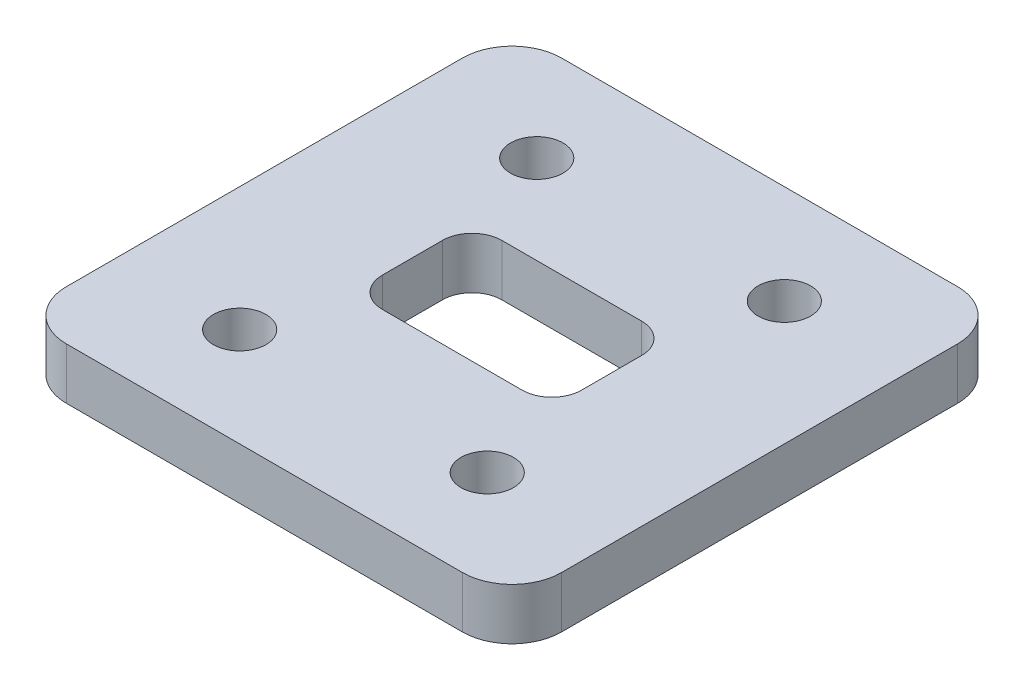
ISO-10303-21;
HEADER;
FILE_DESCRIPTION(('STEP AP214'),'2;1');
FILE_NAME('part.step','',(''),(''),'','','');
FILE_SCHEMA(('AUTOMOTIVE_DESIGN { 1 0 10303 214 1 1 1 1 }'));
ENDSEC;
DATA;
#1=APPLICATION_CONTEXT('core data for automotive mechanical design processes');
#2=APPLICATION_PROTOCOL_DEFINITION('international standard','automotive_design',2000,#1);
#3=PRODUCT_CONTEXT('',#1,'mechanical');
#4=PRODUCT('Part','Part','',(#3));
#5=PRODUCT_RELATED_PRODUCT_CATEGORY('part','',(#4));
#6=PRODUCT_DEFINITION_FORMATION('','',#4);
#7=PRODUCT_DEFINITION_CONTEXT('part definition',#1,'design');
#8=PRODUCT_DEFINITION('design','',#6,#7);
#9=PRODUCT_DEFINITION_SHAPE('','',#8);
#10=(LENGTH_UNIT() NAMED_UNIT(*) SI_UNIT(.MILLI.,.METRE.));
#11=(NAMED_UNIT(*) PLANE_ANGLE_UNIT() SI_UNIT($,.RADIAN.));
#12=(NAMED_UNIT(*) SI_UNIT($,.STERADIAN.) SOLID_ANGLE_UNIT());
#13=UNCERTAINTY_MEASURE_WITH_UNIT(LENGTH_MEASURE(1.E-05),#10,'distance_accuracy_value','');
#14=(GEOMETRIC_REPRESENTATION_CONTEXT(3) GLOBAL_UNCERTAINTY_ASSIGNED_CONTEXT((#13)) GLOBAL_UNIT_ASSIGNED_CONTEXT((#10,
#11,#12)) REPRESENTATION_CONTEXT('',''));
#15=CARTESIAN_POINT('',(0.,0.,0.));
#16=DIRECTION('',(0.,0.,1.));
#17=DIRECTION('',(1.,0.,0.));
#18=AXIS2_PLACEMENT_3D('',#15,#16,#17);
#19=CARTESIAN_POINT('',(-10.0602247248147,8.,0.));
#20=DIRECTION('',(-1.,0.,0.));
#21=DIRECTION('',(0.,0.,1.));
#22=AXIS2_PLACEMENT_3D('',#19,#20,#21);
#23=PLANE('',#22);
#24=DIRECTION('',(0.,0.,1.));
#25=VECTOR('',#24,1.);
#26=CARTESIAN_POINT('',(-10.0602247248147,5.2,0.));
#27=LINE('',#26,#25);
#28=CARTESIAN_POINT('',(-10.0602247248147,5.2,-3.0356709098681));
#29=VERTEX_POINT('',#28);
#30=CARTESIAN_POINT('',(-10.0602247248147,5.2,3.03567090986811));
#31=VERTEX_POINT('',#30);
#32=EDGE_CURVE('E304',#29,#31,#27,.T.);
#33=ORIENTED_EDGE('',*,*,#32,.T.);
#34=DIRECTION('',(0.,-1.,0.));
#35=VECTOR('',#34,1.);
#36=CARTESIAN_POINT('',(-10.0602247248147,8.,3.03567090986811));
#37=LINE('',#36,#35);
#38=CARTESIAN_POINT('',(-10.0602247248147,0.,3.03567090986811));
#39=VERTEX_POINT('',#38);
#40=EDGE_CURVE('E313',#31,#39,#37,.T.);
#41=ORIENTED_EDGE('',*,*,#40,.T.);
#42=DIRECTION('',(0.,0.,-1.));
#43=VECTOR('',#42,1.);
#44=CARTESIAN_POINT('',(-10.0602247248147,0.,0.));
#45=LINE('',#44,#43);
#46=CARTESIAN_POINT('',(-10.0602247248147,0.,-3.0356709098681));
#47=VERTEX_POINT('',#46);
#48=EDGE_CURVE('E402',#39,#47,#45,.T.);
#49=ORIENTED_EDGE('',*,*,#48,.T.);
#50=DIRECTION('',(0.,-1.,0.));
#51=VECTOR('',#50,1.);
#52=CARTESIAN_POINT('',(-10.0602247248147,8.,-3.0356709098681));
#53=LINE('',#52,#51);
#54=EDGE_CURVE('E12',#29,#47,#53,.T.);
#55=ORIENTED_EDGE('',*,*,#54,.F.);
#56=EDGE_LOOP('',(#33,#41,#49,#55));
#57=FACE_BOUND('',#56,.T.);
#58=ADVANCED_FACE('F190',(#57),#23,.F.);
#59=CARTESIAN_POINT('',(-7.06022472481465,8.,-3.03567090986813));
#60=DIRECTION('',(0.,-1.,0.));
#61=DIRECTION('',(0.,0.,-1.));
#62=AXIS2_PLACEMENT_3D('',#59,#60,#61);
#63=CYLINDRICAL_SURFACE('',#62,3.);
#64=CARTESIAN_POINT('',(-7.06022472481465,5.2,-3.03567090986813));
#65=DIRECTION('',(0.,1.,0.));
#66=DIRECTION('',(0.,0.,1.));
#67=AXIS2_PLACEMENT_3D('',#64,#65,#66);
#68=CIRCLE('',#67,3.);
#69=CARTESIAN_POINT('',(-7.06022472481463,5.2,-6.03567090986813));
#70=VERTEX_POINT('',#69);
#71=EDGE_CURVE('E315',#70,#29,#68,.T.);
#72=ORIENTED_EDGE('',*,*,#71,.T.);
#73=ORIENTED_EDGE('',*,*,#54,.T.);
#74=CARTESIAN_POINT('',(-7.06022472481465,0.,-3.03567090986813));
#75=DIRECTION('',(0.,1.,0.));
#76=DIRECTION('',(0.,0.,1.));
#77=AXIS2_PLACEMENT_3D('',#74,#75,#76);
#78=CIRCLE('',#77,3.);
#79=CARTESIAN_POINT('',(-7.06022472481463,0.,-6.03567090986813));
#80=VERTEX_POINT('',#79);
#81=EDGE_CURVE('E404',#47,#80,#78,.F.);
#82=ORIENTED_EDGE('',*,*,#81,.T.);
#83=DIRECTION('',(0.,-1.,0.));
#84=VECTOR('',#83,1.);
#85=CARTESIAN_POINT('',(-7.06022472481463,8.,-6.03567090986813));
#86=LINE('',#85,#84);
#87=EDGE_CURVE('E199',#70,#80,#86,.T.);
#88=ORIENTED_EDGE('',*,*,#87,.F.);
#89=EDGE_LOOP('',(#72,#73,#82,#88));
#90=FACE_BOUND('',#89,.T.);
#91=ADVANCED_FACE('F450',(#90),#63,.F.);
#92=CARTESIAN_POINT('',(0.,8.,-6.03567090986813));
#93=DIRECTION('',(0.,0.,-1.));
#94=DIRECTION('',(-1.,0.,0.));
#95=AXIS2_PLACEMENT_3D('',#92,#93,#94);
#96=PLANE('',#95);
#97=DIRECTION('',(-1.,0.,0.));
#98=VECTOR('',#97,1.);
#99=CARTESIAN_POINT('',(0.,5.2,-6.03567090986813));
#100=LINE('',#99,#98);
#101=CARTESIAN_POINT('',(7.06022472481462,5.2,-6.03567090986813));
#102=VERTEX_POINT('',#101);
#103=EDGE_CURVE('E448',#102,#70,#100,.T.);
#104=ORIENTED_EDGE('',*,*,#103,.T.);
#105=ORIENTED_EDGE('',*,*,#87,.T.);
#106=DIRECTION('',(1.,0.,0.));
#107=VECTOR('',#106,1.);
#108=CARTESIAN_POINT('',(0.,0.,-6.03567090986813));
#109=LINE('',#108,#107);
#110=CARTESIAN_POINT('',(7.06022472481462,0.,-6.03567090986813));
#111=VERTEX_POINT('',#110);
#112=EDGE_CURVE('E407',#80,#111,#109,.T.);
#113=ORIENTED_EDGE('',*,*,#112,.T.);
#114=DIRECTION('',(0.,-1.,0.));
#115=VECTOR('',#114,1.);
#116=CARTESIAN_POINT('',(7.06022472481462,8.,-6.03567090986813));
#117=LINE('',#116,#115);
#118=EDGE_CURVE('E334',#102,#111,#117,.T.);
#119=ORIENTED_EDGE('',*,*,#118,.F.);
#120=EDGE_LOOP('',(#104,#105,#113,#119));
#121=FACE_BOUND('',#120,.T.);
#122=ADVANCED_FACE('F446',(#121),#96,.F.);
#123=CARTESIAN_POINT('',(7.06022472481465,8.,-3.03567090986813));
#124=DIRECTION('',(0.,-1.,0.));
#125=DIRECTION('',(0.,0.,-1.));
#126=AXIS2_PLACEMENT_3D('',#123,#124,#125);
#127=CYLINDRICAL_SURFACE('',#126,3.);
#128=DIRECTION('',(0.,-1.,0.));
#129=VECTOR('',#128,1.);
#130=CARTESIAN_POINT('',(10.0602247248146,8.,-3.0356709098681));
#131=LINE('',#130,#129);
#132=CARTESIAN_POINT('',(10.0602247248146,5.2,-3.0356709098681));
#133=VERTEX_POINT('',#132);
#134=CARTESIAN_POINT('',(10.0602247248146,0.,-3.0356709098681));
#135=VERTEX_POINT('',#134);
#136=EDGE_CURVE('E332',#133,#135,#131,.T.);
#137=ORIENTED_EDGE('',*,*,#136,.F.);
#138=CARTESIAN_POINT('',(7.06022472481465,5.2,-3.03567090986813));
#139=DIRECTION('',(0.,1.,0.));
#140=DIRECTION('',(0.,0.,1.));
#141=AXIS2_PLACEMENT_3D('',#138,#139,#140);
#142=CIRCLE('',#141,3.);
#143=EDGE_CURVE('E443',#133,#102,#142,.T.);
#144=ORIENTED_EDGE('',*,*,#143,.T.);
#145=ORIENTED_EDGE('',*,*,#118,.T.);
#146=CARTESIAN_POINT('',(7.06022472481465,0.,-3.03567090986813));
#147=DIRECTION('',(0.,1.,0.));
#148=DIRECTION('',(0.,0.,1.));
#149=AXIS2_PLACEMENT_3D('',#146,#147,#148);
#150=CIRCLE('',#149,3.);
#151=EDGE_CURVE('E410',#135,#111,#150,.T.);
#152=ORIENTED_EDGE('',*,*,#151,.F.);
#153=EDGE_LOOP('',(#137,#144,#145,#152));
#154=FACE_BOUND('',#153,.T.);
#155=ADVANCED_FACE('F440',(#154),#127,.F.);
#156=CARTESIAN_POINT('',(10.0602247248146,8.,0.));
#157=DIRECTION('',(-1.,0.,0.));
#158=DIRECTION('',(0.,0.,1.));
#159=AXIS2_PLACEMENT_3D('',#156,#157,#158);
#160=PLANE('',#159);
#161=DIRECTION('',(0.,-1.,0.));
#162=VECTOR('',#161,1.);
#163=CARTESIAN_POINT('',(10.0602247248146,8.,3.03567090986811));
#164=LINE('',#163,#162);
#165=CARTESIAN_POINT('',(10.0602247248146,5.2,3.03567090986811));
#166=VERTEX_POINT('',#165);
#167=CARTESIAN_POINT('',(10.0602247248146,0.,3.03567090986811));
#168=VERTEX_POINT('',#167);
#169=EDGE_CURVE('E330',#166,#168,#164,.T.);
#170=ORIENTED_EDGE('',*,*,#169,.F.);
#171=DIRECTION('',(0.,0.,1.));
#172=VECTOR('',#171,1.);
#173=CARTESIAN_POINT('',(10.0602247248146,5.2,0.));
#174=LINE('',#173,#172);
#175=EDGE_CURVE('E455',#133,#166,#174,.T.);
#176=ORIENTED_EDGE('',*,*,#175,.F.);
#177=ORIENTED_EDGE('',*,*,#136,.T.);
#178=DIRECTION('',(0.,0.,-1.));
#179=VECTOR('',#178,1.);
#180=CARTESIAN_POINT('',(10.0602247248146,0.,0.));
#181=LINE('',#180,#179);
#182=EDGE_CURVE('E413',#168,#135,#181,.T.);
#183=ORIENTED_EDGE('',*,*,#182,.F.);
#184=EDGE_LOOP('',(#170,#176,#177,#183));
#185=FACE_BOUND('',#184,.T.);
#186=ADVANCED_FACE('F434',(#185),#160,.T.);
#187=CARTESIAN_POINT('',(7.06022472481465,8.,3.03567090986813));
#188=DIRECTION('',(0.,-1.,0.));
#189=DIRECTION('',(0.,0.,-1.));
#190=AXIS2_PLACEMENT_3D('',#187,#188,#189);
#191=CYLINDRICAL_SURFACE('',#190,3.);
#192=DIRECTION('',(0.,-1.,0.));
#193=VECTOR('',#192,1.);
#194=CARTESIAN_POINT('',(7.06022472481462,8.,6.03567090986813));
#195=LINE('',#194,#193);
#196=CARTESIAN_POINT('',(7.06022472481462,5.2,6.03567090986813));
#197=VERTEX_POINT('',#196);
#198=CARTESIAN_POINT('',(7.06022472481462,0.,6.03567090986813));
#199=VERTEX_POINT('',#198);
#200=EDGE_CURVE('E323',#197,#199,#195,.T.);
#201=ORIENTED_EDGE('',*,*,#200,.F.);
#202=CARTESIAN_POINT('',(7.06022472481465,5.2,3.03567090986813));
#203=DIRECTION('',(0.,1.,0.));
#204=DIRECTION('',(0.,0.,1.));
#205=AXIS2_PLACEMENT_3D('',#202,#203,#204);
#206=CIRCLE('',#205,3.);
#207=EDGE_CURVE('E431',#197,#166,#206,.T.);
#208=ORIENTED_EDGE('',*,*,#207,.T.);
#209=ORIENTED_EDGE('',*,*,#169,.T.);
#210=CARTESIAN_POINT('',(7.06022472481465,0.,3.03567090986813));
#211=DIRECTION('',(0.,1.,0.));
#212=DIRECTION('',(0.,0.,1.));
#213=AXIS2_PLACEMENT_3D('',#210,#211,#212);
#214=CIRCLE('',#213,3.);
#215=EDGE_CURVE('E416',#199,#168,#214,.T.);
#216=ORIENTED_EDGE('',*,*,#215,.F.);
#217=EDGE_LOOP('',(#201,#208,#209,#216));
#218=FACE_BOUND('',#217,.T.);
#219=ADVANCED_FACE('F428',(#218),#191,.F.);
#220=CARTESIAN_POINT('',(0.,8.,6.03567090986813));
#221=DIRECTION('',(0.,0.,-1.));
#222=DIRECTION('',(-1.,0.,0.));
#223=AXIS2_PLACEMENT_3D('',#220,#221,#222);
#224=PLANE('',#223);
#225=DIRECTION('',(0.,-1.,0.));
#226=VECTOR('',#225,1.);
#227=CARTESIAN_POINT('',(-7.06022472481463,8.,6.03567090986813));
#228=LINE('',#227,#226);
#229=CARTESIAN_POINT('',(-7.06022472481463,5.2,6.03567090986813));
#230=VERTEX_POINT('',#229);
#231=CARTESIAN_POINT('',(-7.06022472481463,0.,6.03567090986813));
#232=VERTEX_POINT('',#231);
#233=EDGE_CURVE('E321',#230,#232,#228,.T.);
#234=ORIENTED_EDGE('',*,*,#233,.F.);
#235=DIRECTION('',(-1.,0.,0.));
#236=VECTOR('',#235,1.);
#237=CARTESIAN_POINT('',(0.,5.2,6.03567090986813));
#238=LINE('',#237,#236);
#239=EDGE_CURVE('E215',#197,#230,#238,.T.);
#240=ORIENTED_EDGE('',*,*,#239,.F.);
#241=ORIENTED_EDGE('',*,*,#200,.T.);
#242=DIRECTION('',(1.,0.,0.));
#243=VECTOR('',#242,1.);
#244=CARTESIAN_POINT('',(0.,0.,6.03567090986813));
#245=LINE('',#244,#243);
#246=EDGE_CURVE('E418',#232,#199,#245,.T.);
#247=ORIENTED_EDGE('',*,*,#246,.F.);
#248=EDGE_LOOP('',(#234,#240,#241,#247));
#249=FACE_BOUND('',#248,.T.);
#250=ADVANCED_FACE('F424',(#249),#224,.T.);
#251=CARTESIAN_POINT('',(-20.,8.,-20.));
#252=DIRECTION('',(0.,-1.,0.));
#253=DIRECTION('',(0.,0.,-1.));
#254=AXIS2_PLACEMENT_3D('',#251,#252,#253);
#255=CYLINDRICAL_SURFACE('',#254,5.);
#256=DIRECTION('',(0.,-1.,0.));
#257=VECTOR('',#256,1.);
#258=CARTESIAN_POINT('',(-25.,8.,-20.));
#259=LINE('',#258,#257);
#260=CARTESIAN_POINT('',(-25.,5.2,-20.));
#261=VERTEX_POINT('',#260);
#262=CARTESIAN_POINT('',(-25.,0.,-20.));
#263=VERTEX_POINT('',#262);
#264=EDGE_CURVE('E194',#261,#263,#259,.T.);
#265=ORIENTED_EDGE('',*,*,#264,.F.);
#266=CARTESIAN_POINT('',(-20.,5.2,-20.));
#267=DIRECTION('',(0.,1.,0.));
#268=DIRECTION('',(0.,0.,1.));
#269=AXIS2_PLACEMENT_3D('',#266,#267,#268);
#270=CIRCLE('',#269,5.);
#271=CARTESIAN_POINT('',(-20.,5.2,-25.));
#272=VERTEX_POINT('',#271);
#273=EDGE_CURVE('E481',#272,#261,#270,.T.);
#274=ORIENTED_EDGE('',*,*,#273,.F.);
#275=DIRECTION('',(0.,-1.,0.));
#276=VECTOR('',#275,1.);
#277=CARTESIAN_POINT('',(-20.,8.,-25.));
#278=LINE('',#277,#276);
#279=CARTESIAN_POINT('',(-20.,0.,-25.));
#280=VERTEX_POINT('',#279);
#281=EDGE_CURVE('E337',#272,#280,#278,.T.);
#282=ORIENTED_EDGE('',*,*,#281,.T.);
#283=CARTESIAN_POINT('',(-20.,0.,-20.));
#284=DIRECTION('',(0.,1.,0.));
#285=DIRECTION('',(0.,0.,1.));
#286=AXIS2_PLACEMENT_3D('',#283,#284,#285);
#287=CIRCLE('',#286,5.);
#288=EDGE_CURVE('E367',#263,#280,#287,.F.);
#289=ORIENTED_EDGE('',*,*,#288,.F.);
#290=EDGE_LOOP('',(#265,#274,#282,#289));
#291=FACE_BOUND('',#290,.T.);
#292=ADVANCED_FACE('F192',(#291),#255,.T.);
#293=CARTESIAN_POINT('',(-25.,8.,0.));
#294=DIRECTION('',(-1.,0.,0.));
#295=DIRECTION('',(0.,0.,1.));
#296=AXIS2_PLACEMENT_3D('',#293,#294,#295);
#297=PLANE('',#296);
#298=DIRECTION('',(0.,-1.,0.));
#299=VECTOR('',#298,1.);
#300=CARTESIAN_POINT('',(-25.,8.,20.));
#301=LINE('',#300,#299);
#302=CARTESIAN_POINT('',(-25.,5.2,20.));
#303=VERTEX_POINT('',#302);
#304=CARTESIAN_POINT('',(-25.,0.,20.));
#305=VERTEX_POINT('',#304);
#306=EDGE_CURVE('E325',#303,#305,#301,.T.);
#307=ORIENTED_EDGE('',*,*,#306,.F.);
#308=DIRECTION('',(0.,0.,1.));
#309=VECTOR('',#308,1.);
#310=CARTESIAN_POINT('',(-25.,5.2,0.));
#311=LINE('',#310,#309);
#312=EDGE_CURVE('E479',#261,#303,#311,.T.);
#313=ORIENTED_EDGE('',*,*,#312,.F.);
#314=ORIENTED_EDGE('',*,*,#264,.T.);
#315=DIRECTION('',(0.,0.,-1.));
#316=VECTOR('',#315,1.);
#317=CARTESIAN_POINT('',(-25.,0.,0.));
#318=LINE('',#317,#316);
#319=EDGE_CURVE('E361',#305,#263,#318,.T.);
#320=ORIENTED_EDGE('',*,*,#319,.F.);
#321=EDGE_LOOP('',(#307,#313,#314,#320));
#322=FACE_BOUND('',#321,.T.);
#323=ADVANCED_FACE('F362',(#322),#297,.T.);
#324=CARTESIAN_POINT('',(-20.,8.,20.));
#325=DIRECTION('',(0.,-1.,0.));
#326=DIRECTION('',(0.,0.,-1.));
#327=AXIS2_PLACEMENT_3D('',#324,#325,#326);
#328=CYLINDRICAL_SURFACE('',#327,5.);
#329=DIRECTION('',(0.,-1.,0.));
#330=VECTOR('',#329,1.);
#331=CARTESIAN_POINT('',(-20.,8.,25.));
#332=LINE('',#331,#330);
#333=CARTESIAN_POINT('',(-20.,5.2,25.));
#334=VERTEX_POINT('',#333);
#335=CARTESIAN_POINT('',(-20.,0.,25.));
#336=VERTEX_POINT('',#335);
#337=EDGE_CURVE('E347',#334,#336,#332,.T.);
#338=ORIENTED_EDGE('',*,*,#337,.F.);
#339=CARTESIAN_POINT('',(-20.,5.2,20.));
#340=DIRECTION('',(0.,1.,0.));
#341=DIRECTION('',(0.,0.,1.));
#342=AXIS2_PLACEMENT_3D('',#339,#340,#341);
#343=CIRCLE('',#342,5.);
#344=EDGE_CURVE('E357',#303,#334,#343,.T.);
#345=ORIENTED_EDGE('',*,*,#344,.F.);
#346=ORIENTED_EDGE('',*,*,#306,.T.);
#347=CARTESIAN_POINT('',(-20.,0.,20.));
#348=DIRECTION('',(0.,1.,0.));
#349=DIRECTION('',(0.,0.,1.));
#350=AXIS2_PLACEMENT_3D('',#347,#348,#349);
#351=CIRCLE('',#350,5.);
#352=EDGE_CURVE('E356',#336,#305,#351,.F.);
#353=ORIENTED_EDGE('',*,*,#352,.F.);
#354=EDGE_LOOP('',(#338,#345,#346,#353));
#355=FACE_BOUND('',#354,.T.);
#356=ADVANCED_FACE('F354',(#355),#328,.T.);
#357=CARTESIAN_POINT('',(0.,8.,25.));
#358=DIRECTION('',(0.,0.,-1.));
#359=DIRECTION('',(-1.,0.,0.));
#360=AXIS2_PLACEMENT_3D('',#357,#358,#359);
#361=PLANE('',#360);
#362=DIRECTION('',(-1.,0.,0.));
#363=VECTOR('',#362,1.);
#364=CARTESIAN_POINT('',(0.,5.2,25.));
#365=LINE('',#364,#363);
#366=CARTESIAN_POINT('',(20.,5.2,25.));
#367=VERTEX_POINT('',#366);
#368=EDGE_CURVE('E475',#367,#334,#365,.T.);
#369=ORIENTED_EDGE('',*,*,#368,.T.);
#370=ORIENTED_EDGE('',*,*,#337,.T.);
#371=DIRECTION('',(1.,0.,0.));
#372=VECTOR('',#371,1.);
#373=CARTESIAN_POINT('',(0.,0.,25.));
#374=LINE('',#373,#372);
#375=CARTESIAN_POINT('',(20.,0.,25.));
#376=VERTEX_POINT('',#375);
#377=EDGE_CURVE('E374',#336,#376,#374,.T.);
#378=ORIENTED_EDGE('',*,*,#377,.T.);
#379=DIRECTION('',(0.,-1.,0.));
#380=VECTOR('',#379,1.);
#381=CARTESIAN_POINT('',(20.,8.,25.));
#382=LINE('',#381,#380);
#383=EDGE_CURVE('E345',#367,#376,#382,.T.);
#384=ORIENTED_EDGE('',*,*,#383,.F.);
#385=EDGE_LOOP('',(#369,#370,#378,#384));
#386=FACE_BOUND('',#385,.T.);
#387=ADVANCED_FACE('F504',(#386),#361,.F.);
#388=CARTESIAN_POINT('',(20.,8.,20.));
#389=DIRECTION('',(0.,-1.,0.));
#390=DIRECTION('',(0.,0.,-1.));
#391=AXIS2_PLACEMENT_3D('',#388,#389,#390);
#392=CYLINDRICAL_SURFACE('',#391,5.);
#393=DIRECTION('',(0.,-1.,0.));
#394=VECTOR('',#393,1.);
#395=CARTESIAN_POINT('',(25.,8.,20.));
#396=LINE('',#395,#394);
#397=CARTESIAN_POINT('',(25.,5.2,20.));
#398=VERTEX_POINT('',#397);
#399=CARTESIAN_POINT('',(25.,0.,20.));
#400=VERTEX_POINT('',#399);
#401=EDGE_CURVE('E343',#398,#400,#396,.T.);
#402=ORIENTED_EDGE('',*,*,#401,.F.);
#403=CARTESIAN_POINT('',(20.,5.2,20.));
#404=DIRECTION('',(0.,1.,0.));
#405=DIRECTION('',(0.,0.,1.));
#406=AXIS2_PLACEMENT_3D('',#403,#404,#405);
#407=CIRCLE('',#406,5.);
#408=EDGE_CURVE('E473',#367,#398,#407,.T.);
#409=ORIENTED_EDGE('',*,*,#408,.F.);
#410=ORIENTED_EDGE('',*,*,#383,.T.);
#411=CARTESIAN_POINT('',(20.,0.,20.));
#412=DIRECTION('',(0.,1.,0.));
#413=DIRECTION('',(0.,0.,1.));
#414=AXIS2_PLACEMENT_3D('',#411,#412,#413);
#415=CIRCLE('',#414,5.);
#416=EDGE_CURVE('E376',#400,#376,#415,.F.);
#417=ORIENTED_EDGE('',*,*,#416,.F.);
#418=EDGE_LOOP('',(#402,#409,#410,#417));
#419=FACE_BOUND('',#418,.T.);
#420=ADVANCED_FACE('F500',(#419),#392,.T.);
#421=CARTESIAN_POINT('',(25.,8.,0.));
#422=DIRECTION('',(-1.,0.,0.));
#423=DIRECTION('',(0.,0.,1.));
#424=AXIS2_PLACEMENT_3D('',#421,#422,#423);
#425=PLANE('',#424);
#426=DIRECTION('',(0.,0.,1.));
#427=VECTOR('',#426,1.);
#428=CARTESIAN_POINT('',(25.,5.2,0.));
#429=LINE('',#428,#427);
#430=CARTESIAN_POINT('',(25.,5.2,-20.));
#431=VERTEX_POINT('',#430);
#432=EDGE_CURVE('E470',#431,#398,#429,.T.);
#433=ORIENTED_EDGE('',*,*,#432,.T.);
#434=ORIENTED_EDGE('',*,*,#401,.T.);
#435=DIRECTION('',(0.,0.,-1.));
#436=VECTOR('',#435,1.);
#437=CARTESIAN_POINT('',(25.,0.,0.));
#438=LINE('',#437,#436);
#439=CARTESIAN_POINT('',(25.,0.,-20.));
#440=VERTEX_POINT('',#439);
#441=EDGE_CURVE('E381',#400,#440,#438,.T.);
#442=ORIENTED_EDGE('',*,*,#441,.T.);
#443=DIRECTION('',(0.,-1.,0.));
#444=VECTOR('',#443,1.);
#445=CARTESIAN_POINT('',(25.,8.,-20.));
#446=LINE('',#445,#444);
#447=EDGE_CURVE('E341',#431,#440,#446,.T.);
#448=ORIENTED_EDGE('',*,*,#447,.F.);
#449=EDGE_LOOP('',(#433,#434,#442,#448));
#450=FACE_BOUND('',#449,.T.);
#451=ADVANCED_FACE('F541',(#450),#425,.F.);
#452=CARTESIAN_POINT('',(20.,8.,-20.));
#453=DIRECTION('',(0.,-1.,0.));
#454=DIRECTION('',(0.,0.,-1.));
#455=AXIS2_PLACEMENT_3D('',#452,#453,#454);
#456=CYLINDRICAL_SURFACE('',#455,5.);
#457=CARTESIAN_POINT('',(20.,5.2,-20.));
#458=DIRECTION('',(0.,1.,0.));
#459=DIRECTION('',(0.,0.,1.));
#460=AXIS2_PLACEMENT_3D('',#457,#458,#459);
#461=CIRCLE('',#460,5.);
#462=CARTESIAN_POINT('',(20.,5.2,-25.));
#463=VERTEX_POINT('',#462);
#464=EDGE_CURVE('E207',#431,#463,#461,.T.);
#465=ORIENTED_EDGE('',*,*,#464,.F.);
#466=ORIENTED_EDGE('',*,*,#447,.T.);
#467=CARTESIAN_POINT('',(20.,0.,-20.));
#468=DIRECTION('',(0.,1.,0.));
#469=DIRECTION('',(0.,0.,1.));
#470=AXIS2_PLACEMENT_3D('',#467,#468,#469);
#471=CIRCLE('',#470,5.);
#472=CARTESIAN_POINT('',(20.,0.,-25.));
#473=VERTEX_POINT('',#472);
#474=EDGE_CURVE('E384',#440,#473,#471,.T.);
#475=ORIENTED_EDGE('',*,*,#474,.T.);
#476=DIRECTION('',(0.,-1.,0.));
#477=VECTOR('',#476,1.);
#478=CARTESIAN_POINT('',(20.,8.,-25.));
#479=LINE('',#478,#477);
#480=EDGE_CURVE('E339',#463,#473,#479,.T.);
#481=ORIENTED_EDGE('',*,*,#480,.F.);
#482=EDGE_LOOP('',(#465,#466,#475,#481));
#483=FACE_BOUND('',#482,.T.);
#484=ADVANCED_FACE('F493',(#483),#456,.T.);
#485=CARTESIAN_POINT('',(12.5,8.,-15.));
#486=DIRECTION('',(0.,-1.,0.));
#487=DIRECTION('',(0.,0.,-1.));
#488=AXIS2_PLACEMENT_3D('',#485,#486,#487);
#489=CYLINDRICAL_SURFACE('',#488,2.65);
#490=CARTESIAN_POINT('',(12.5,0.,-15.));
#491=DIRECTION('',(0.,1.,0.));
#492=DIRECTION('',(0.,0.,1.));
#493=AXIS2_PLACEMENT_3D('',#490,#491,#492);
#494=CIRCLE('',#493,2.65);
#495=CARTESIAN_POINT('',(12.5,0.,-12.35));
#496=VERTEX_POINT('',#495);
#497=EDGE_CURVE('E399',#496,#496,#494,.F.);
#498=ORIENTED_EDGE('',*,*,#497,.T.);
#499=EDGE_LOOP('',(#498));
#500=FACE_BOUND('',#499,.T.);
#501=CARTESIAN_POINT('',(12.5,5.2,-15.));
#502=DIRECTION('',(0.,1.,0.));
#503=DIRECTION('',(0.,0.,1.));
#504=AXIS2_PLACEMENT_3D('',#501,#502,#503);
#505=CIRCLE('',#504,2.65);
#506=CARTESIAN_POINT('',(12.5,5.2,-12.35));
#507=VERTEX_POINT('',#506);
#508=EDGE_CURVE('E467',#507,#507,#505,.T.);
#509=ORIENTED_EDGE('',*,*,#508,.T.);
#510=EDGE_LOOP('',(#509));
#511=FACE_BOUND('',#510,.T.);
#512=ADVANCED_FACE('F521',(#500,#511),#489,.F.);
#513=CARTESIAN_POINT('',(-12.5,8.,15.));
#514=DIRECTION('',(0.,-1.,0.));
#515=DIRECTION('',(0.,0.,-1.));
#516=AXIS2_PLACEMENT_3D('',#513,#514,#515);
#517=CYLINDRICAL_SURFACE('',#516,2.65);
#518=CARTESIAN_POINT('',(-12.5,0.,15.));
#519=DIRECTION('',(0.,1.,0.));
#520=DIRECTION('',(0.,0.,1.));
#521=AXIS2_PLACEMENT_3D('',#518,#519,#520);
#522=CIRCLE('',#521,2.65);
#523=CARTESIAN_POINT('',(-12.5,0.,17.65));
#524=VERTEX_POINT('',#523);
#525=EDGE_CURVE('E396',#524,#524,#522,.T.);
#526=ORIENTED_EDGE('',*,*,#525,.F.);
#527=EDGE_LOOP('',(#526));
#528=FACE_BOUND('',#527,.T.);
#529=CARTESIAN_POINT('',(-12.5,5.2,15.));
#530=DIRECTION('',(0.,1.,0.));
#531=DIRECTION('',(0.,0.,1.));
#532=AXIS2_PLACEMENT_3D('',#529,#530,#531);
#533=CIRCLE('',#532,2.65);
#534=CARTESIAN_POINT('',(-12.5,5.2,17.65));
#535=VERTEX_POINT('',#534);
#536=EDGE_CURVE('E464',#535,#535,#533,.T.);
#537=ORIENTED_EDGE('',*,*,#536,.T.);
#538=EDGE_LOOP('',(#537));
#539=FACE_BOUND('',#538,.T.);
#540=ADVANCED_FACE('F524',(#528,#539),#517,.F.);
#541=CARTESIAN_POINT('',(-12.5,8.,-15.));
#542=DIRECTION('',(0.,-1.,0.));
#543=DIRECTION('',(0.,0.,-1.));
#544=AXIS2_PLACEMENT_3D('',#541,#542,#543);
#545=CYLINDRICAL_SURFACE('',#544,2.65);
#546=CARTESIAN_POINT('',(-12.5,0.,-15.));
#547=DIRECTION('',(0.,1.,0.));
#548=DIRECTION('',(0.,0.,1.));
#549=AXIS2_PLACEMENT_3D('',#546,#547,#548);
#550=CIRCLE('',#549,2.65);
#551=CARTESIAN_POINT('',(-12.5,0.,-12.35));
#552=VERTEX_POINT('',#551);
#553=EDGE_CURVE('E393',#552,#552,#550,.T.);
#554=ORIENTED_EDGE('',*,*,#553,.F.);
#555=EDGE_LOOP('',(#554));
#556=FACE_BOUND('',#555,.T.);
#557=CARTESIAN_POINT('',(-12.5,5.2,-15.));
#558=DIRECTION('',(0.,1.,0.));
#559=DIRECTION('',(0.,0.,1.));
#560=AXIS2_PLACEMENT_3D('',#557,#558,#559);
#561=CIRCLE('',#560,2.65);
#562=CARTESIAN_POINT('',(-12.5,5.2,-12.35));
#563=VERTEX_POINT('',#562);
#564=EDGE_CURVE('E461',#563,#563,#561,.T.);
#565=ORIENTED_EDGE('',*,*,#564,.T.);
#566=EDGE_LOOP('',(#565));
#567=FACE_BOUND('',#566,.T.);
#568=ADVANCED_FACE('F528',(#556,#567),#545,.F.);
#569=CARTESIAN_POINT('',(12.5,8.,15.));
#570=DIRECTION('',(0.,-1.,0.));
#571=DIRECTION('',(0.,0.,-1.));
#572=AXIS2_PLACEMENT_3D('',#569,#570,#571);
#573=CYLINDRICAL_SURFACE('',#572,2.65);
#574=CARTESIAN_POINT('',(12.5,0.,15.));
#575=DIRECTION('',(0.,1.,0.));
#576=DIRECTION('',(0.,0.,1.));
#577=AXIS2_PLACEMENT_3D('',#574,#575,#576);
#578=CIRCLE('',#577,2.65);
#579=CARTESIAN_POINT('',(12.5,0.,17.65));
#580=VERTEX_POINT('',#579);
#581=EDGE_CURVE('E390',#580,#580,#578,.F.);
#582=ORIENTED_EDGE('',*,*,#581,.T.);
#583=EDGE_LOOP('',(#582));
#584=FACE_BOUND('',#583,.T.);
#585=CARTESIAN_POINT('',(12.5,5.2,15.));
#586=DIRECTION('',(0.,1.,0.));
#587=DIRECTION('',(0.,0.,1.));
#588=AXIS2_PLACEMENT_3D('',#585,#586,#587);
#589=CIRCLE('',#588,2.65);
#590=CARTESIAN_POINT('',(12.5,5.2,17.65));
#591=VERTEX_POINT('',#590);
#592=EDGE_CURVE('E458',#591,#591,#589,.T.);
#593=ORIENTED_EDGE('',*,*,#592,.T.);
#594=EDGE_LOOP('',(#593));
#595=FACE_BOUND('',#594,.T.);
#596=ADVANCED_FACE('F532',(#584,#595),#573,.F.);
#597=CARTESIAN_POINT('',(0.,8.,-25.));
#598=DIRECTION('',(0.,0.,-1.));
#599=DIRECTION('',(-1.,0.,0.));
#600=AXIS2_PLACEMENT_3D('',#597,#598,#599);
#601=PLANE('',#600);
#602=ORIENTED_EDGE('',*,*,#281,.F.);
#603=DIRECTION('',(-1.,0.,0.));
#604=VECTOR('',#603,1.);
#605=CARTESIAN_POINT('',(0.,5.2,-25.));
#606=LINE('',#605,#604);
#607=EDGE_CURVE('E483',#463,#272,#606,.T.);
#608=ORIENTED_EDGE('',*,*,#607,.F.);
#609=ORIENTED_EDGE('',*,*,#480,.T.);
#610=DIRECTION('',(1.,0.,0.));
#611=VECTOR('',#610,1.);
#612=CARTESIAN_POINT('',(0.,0.,-25.));
#613=LINE('',#612,#611);
#614=EDGE_CURVE('E387',#280,#473,#613,.T.);
#615=ORIENTED_EDGE('',*,*,#614,.F.);
#616=EDGE_LOOP('',(#602,#608,#609,#615));
#617=FACE_BOUND('',#616,.T.);
#618=ADVANCED_FACE('F490',(#617),#601,.T.);
#619=CARTESIAN_POINT('',(-7.06022472481465,8.,3.03567090986813));
#620=DIRECTION('',(0.,-1.,0.));
#621=DIRECTION('',(0.,0.,-1.));
#622=AXIS2_PLACEMENT_3D('',#619,#620,#621);
#623=CYLINDRICAL_SURFACE('',#622,3.);
#624=CARTESIAN_POINT('',(-7.06022472481465,5.2,3.03567090986813));
#625=DIRECTION('',(0.,1.,0.));
#626=DIRECTION('',(0.,0.,1.));
#627=AXIS2_PLACEMENT_3D('',#624,#625,#626);
#628=CIRCLE('',#627,3.);
#629=EDGE_CURVE('E301',#31,#230,#628,.T.);
#630=ORIENTED_EDGE('',*,*,#629,.T.);
#631=ORIENTED_EDGE('',*,*,#233,.T.);
#632=CARTESIAN_POINT('',(-7.06022472481465,0.,3.03567090986813));
#633=DIRECTION('',(0.,1.,0.));
#634=DIRECTION('',(0.,0.,1.));
#635=AXIS2_PLACEMENT_3D('',#632,#633,#634);
#636=CIRCLE('',#635,3.);
#637=EDGE_CURVE('E319',#232,#39,#636,.F.);
#638=ORIENTED_EDGE('',*,*,#637,.T.);
#639=ORIENTED_EDGE('',*,*,#40,.F.);
#640=EDGE_LOOP('',(#630,#631,#638,#639));
#641=FACE_BOUND('',#640,.T.);
#642=ADVANCED_FACE('F317',(#641),#623,.F.);
#643=CARTESIAN_POINT('',(0.,0.,0.));
#644=DIRECTION('',(0.,1.,0.));
#645=DIRECTION('',(0.,0.,1.));
#646=AXIS2_PLACEMENT_3D('',#643,#644,#645);
#647=PLANE('',#646);
#648=ORIENTED_EDGE('',*,*,#288,.T.);
#649=ORIENTED_EDGE('',*,*,#614,.T.);
#650=ORIENTED_EDGE('',*,*,#474,.F.);
#651=ORIENTED_EDGE('',*,*,#441,.F.);
#652=ORIENTED_EDGE('',*,*,#416,.T.);
#653=ORIENTED_EDGE('',*,*,#377,.F.);
#654=ORIENTED_EDGE('',*,*,#352,.T.);
#655=ORIENTED_EDGE('',*,*,#319,.T.);
#656=EDGE_LOOP('',(#648,#649,#650,#651,#652,#653,#654,#655));
#657=FACE_BOUND('',#656,.T.);
#658=ORIENTED_EDGE('',*,*,#581,.F.);
#659=EDGE_LOOP('',(#658));
#660=FACE_BOUND('',#659,.T.);
#661=ORIENTED_EDGE('',*,*,#553,.T.);
#662=EDGE_LOOP('',(#661));
#663=FACE_BOUND('',#662,.T.);
#664=ORIENTED_EDGE('',*,*,#525,.T.);
#665=EDGE_LOOP('',(#664));
#666=FACE_BOUND('',#665,.T.);
#667=ORIENTED_EDGE('',*,*,#497,.F.);
#668=EDGE_LOOP('',(#667));
#669=FACE_BOUND('',#668,.T.);
#670=ORIENTED_EDGE('',*,*,#48,.F.);
#671=ORIENTED_EDGE('',*,*,#637,.F.);
#672=ORIENTED_EDGE('',*,*,#246,.T.);
#673=ORIENTED_EDGE('',*,*,#215,.T.);
#674=ORIENTED_EDGE('',*,*,#182,.T.);
#675=ORIENTED_EDGE('',*,*,#151,.T.);
#676=ORIENTED_EDGE('',*,*,#112,.F.);
#677=ORIENTED_EDGE('',*,*,#81,.F.);
#678=EDGE_LOOP('',(#670,#671,#672,#673,#674,#675,#676,#677));
#679=FACE_BOUND('',#678,.T.);
#680=ADVANCED_FACE('F370',(#657,#660,#663,#666,#669,#679),#647,.F.);
#681=CARTESIAN_POINT('',(20.,5.2,20.));
#682=DIRECTION('',(0.,1.,0.));
#683=DIRECTION('',(0.,0.,1.));
#684=AXIS2_PLACEMENT_3D('',#681,#682,#683);
#685=PLANE('',#684);
#686=ORIENTED_EDGE('',*,*,#432,.F.);
#687=ORIENTED_EDGE('',*,*,#464,.T.);
#688=ORIENTED_EDGE('',*,*,#607,.T.);
#689=ORIENTED_EDGE('',*,*,#273,.T.);
#690=ORIENTED_EDGE('',*,*,#312,.T.);
#691=ORIENTED_EDGE('',*,*,#344,.T.);
#692=ORIENTED_EDGE('',*,*,#368,.F.);
#693=ORIENTED_EDGE('',*,*,#408,.T.);
#694=EDGE_LOOP('',(#686,#687,#688,#689,#690,#691,#692,#693));
#695=FACE_BOUND('',#694,.T.);
#696=ORIENTED_EDGE('',*,*,#508,.F.);
#697=EDGE_LOOP('',(#696));
#698=FACE_BOUND('',#697,.T.);
#699=ORIENTED_EDGE('',*,*,#536,.F.);
#700=EDGE_LOOP('',(#699));
#701=FACE_BOUND('',#700,.T.);
#702=ORIENTED_EDGE('',*,*,#564,.F.);
#703=EDGE_LOOP('',(#702));
#704=FACE_BOUND('',#703,.T.);
#705=ORIENTED_EDGE('',*,*,#592,.F.);
#706=EDGE_LOOP('',(#705));
#707=FACE_BOUND('',#706,.T.);
#708=ORIENTED_EDGE('',*,*,#239,.T.);
#709=ORIENTED_EDGE('',*,*,#629,.F.);
#710=ORIENTED_EDGE('',*,*,#32,.F.);
#711=ORIENTED_EDGE('',*,*,#71,.F.);
#712=ORIENTED_EDGE('',*,*,#103,.F.);
#713=ORIENTED_EDGE('',*,*,#143,.F.);
#714=ORIENTED_EDGE('',*,*,#175,.T.);
#715=ORIENTED_EDGE('',*,*,#207,.F.);
#716=EDGE_LOOP('',(#708,#709,#710,#711,#712,#713,#714,#715));
#717=FACE_BOUND('',#716,.T.);
#718=ADVANCED_FACE('F303',(#695,#698,#701,#704,#707,#717),#685,.T.);
#719=CLOSED_SHELL('',(#58,#91,#122,#155,#186,#219,#250,#292,#323,#356,#387,#420,#451,#484,#512,
#540,#568,#596,#618,#642,#680,#718));
#720=MANIFOLD_SOLID_BREP('B2',#719);
#721=ADVANCED_BREP_SHAPE_REPRESENTATION('',(#18,#720),#14);
#722=SHAPE_DEFINITION_REPRESENTATION(#9,#721);
ENDSEC;
END-ISO-10303-21;
